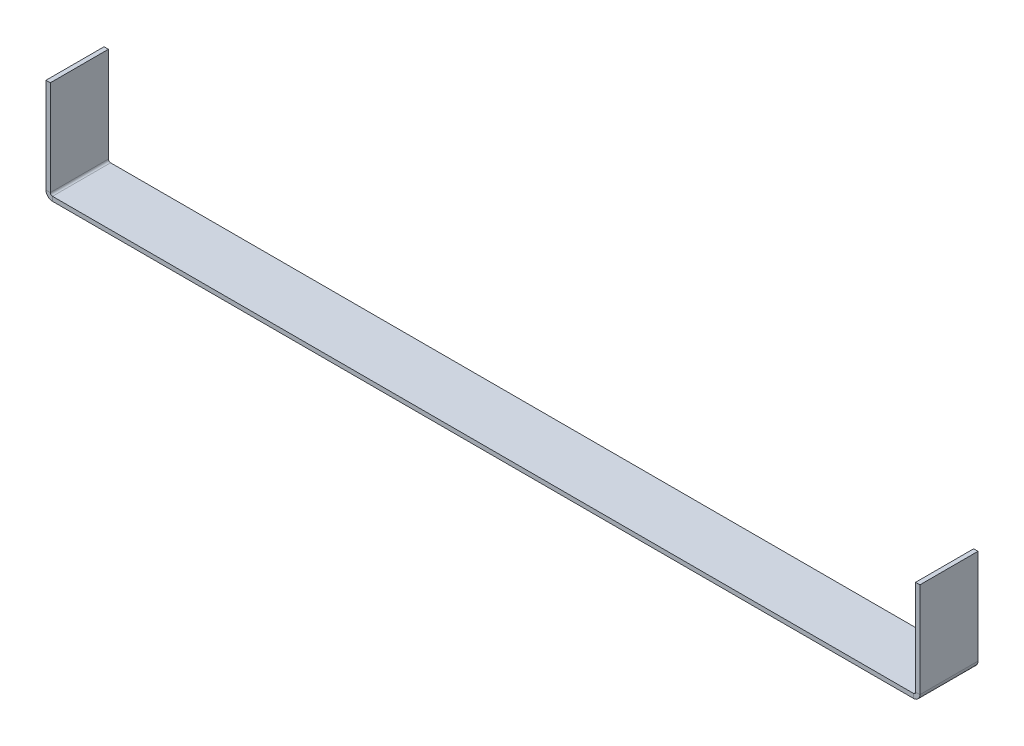
ISO-10303-21;
HEADER;
FILE_DESCRIPTION(('STEP AP214'),'2;1');
FILE_NAME('part.step','',(''),(''),'','','');
FILE_SCHEMA(('AUTOMOTIVE_DESIGN { 1 0 10303 214 1 1 1 1 }'));
ENDSEC;
DATA;
#1=APPLICATION_CONTEXT('core data for automotive mechanical design processes');
#2=APPLICATION_PROTOCOL_DEFINITION('international standard','automotive_design',2000,#1);
#3=PRODUCT_CONTEXT('',#1,'mechanical');
#4=PRODUCT('Part','Part','',(#3));
#5=PRODUCT_RELATED_PRODUCT_CATEGORY('part','',(#4));
#6=PRODUCT_DEFINITION_FORMATION('','',#4);
#7=PRODUCT_DEFINITION_CONTEXT('part definition',#1,'design');
#8=PRODUCT_DEFINITION('design','',#6,#7);
#9=PRODUCT_DEFINITION_SHAPE('','',#8);
#10=(LENGTH_UNIT() NAMED_UNIT(*) SI_UNIT(.MILLI.,.METRE.));
#11=(NAMED_UNIT(*) PLANE_ANGLE_UNIT() SI_UNIT($,.RADIAN.));
#12=(NAMED_UNIT(*) SI_UNIT($,.STERADIAN.) SOLID_ANGLE_UNIT());
#13=UNCERTAINTY_MEASURE_WITH_UNIT(LENGTH_MEASURE(1.E-05),#10,'distance_accuracy_value','');
#14=(GEOMETRIC_REPRESENTATION_CONTEXT(3) GLOBAL_UNCERTAINTY_ASSIGNED_CONTEXT((#13)) GLOBAL_UNIT_ASSIGNED_CONTEXT((#10,
#11,#12)) REPRESENTATION_CONTEXT('',''));
#15=CARTESIAN_POINT('',(0.,0.,0.));
#16=DIRECTION('',(0.,0.,1.));
#17=DIRECTION('',(1.,0.,0.));
#18=AXIS2_PLACEMENT_3D('',#15,#16,#17);
#19=CARTESIAN_POINT('',(0.,-1.5,0.));
#20=DIRECTION('',(0.,-1.,0.));
#21=DIRECTION('',(0.,0.,-1.));
#22=AXIS2_PLACEMENT_3D('',#19,#20,#21);
#23=PLANE('',#22);
#24=DIRECTION('',(-1.,0.,0.));
#25=VECTOR('',#24,1.);
#26=CARTESIAN_POINT('',(0.,-1.5,-20.));
#27=LINE('',#26,#25);
#28=CARTESIAN_POINT('',(298.7634,-1.5,-20.));
#29=VERTEX_POINT('',#28);
#30=CARTESIAN_POINT('',(2.2366,-1.5,-20.));
#31=VERTEX_POINT('',#30);
#32=EDGE_CURVE('E13',#29,#31,#27,.T.);
#33=ORIENTED_EDGE('',*,*,#32,.F.);
#34=DIRECTION('',(0.,0.,-1.));
#35=VECTOR('',#34,1.);
#36=CARTESIAN_POINT('',(298.7634,-1.5,-20.));
#37=LINE('',#36,#35);
#38=CARTESIAN_POINT('',(298.7634,-1.5,0.));
#39=VERTEX_POINT('',#38);
#40=EDGE_CURVE('E326',#29,#39,#37,.F.);
#41=ORIENTED_EDGE('',*,*,#40,.T.);
#42=DIRECTION('',(1.,0.,0.));
#43=VECTOR('',#42,1.);
#44=CARTESIAN_POINT('',(0.,-1.5,0.));
#45=LINE('',#44,#43);
#46=CARTESIAN_POINT('',(2.2366,-1.5,0.));
#47=VERTEX_POINT('',#46);
#48=EDGE_CURVE('E87',#47,#39,#45,.T.);
#49=ORIENTED_EDGE('',*,*,#48,.F.);
#50=DIRECTION('',(0.,0.,1.));
#51=VECTOR('',#50,1.);
#52=CARTESIAN_POINT('',(2.2366,-1.5,0.));
#53=LINE('',#52,#51);
#54=EDGE_CURVE('E101',#47,#31,#53,.F.);
#55=ORIENTED_EDGE('',*,*,#54,.T.);
#56=EDGE_LOOP('',(#33,#41,#49,#55));
#57=FACE_BOUND('',#56,.T.);
#58=ADVANCED_FACE('F78',(#57),#23,.T.);
#59=CARTESIAN_POINT('',(0.,0.,0.));
#60=DIRECTION('',(0.,-1.,0.));
#61=DIRECTION('',(0.,0.,-1.));
#62=AXIS2_PLACEMENT_3D('',#59,#60,#61);
#63=PLANE('',#62);
#64=DIRECTION('',(0.,0.,-1.));
#65=VECTOR('',#64,1.);
#66=CARTESIAN_POINT('',(298.7634,0.,-20.));
#67=LINE('',#66,#65);
#68=CARTESIAN_POINT('',(298.7634,0.,-20.));
#69=VERTEX_POINT('',#68);
#70=CARTESIAN_POINT('',(298.7634,0.,0.));
#71=VERTEX_POINT('',#70);
#72=EDGE_CURVE('E198',#69,#71,#67,.F.);
#73=ORIENTED_EDGE('',*,*,#72,.F.);
#74=DIRECTION('',(-1.,0.,0.));
#75=VECTOR('',#74,1.);
#76=CARTESIAN_POINT('',(0.,0.,-20.));
#77=LINE('',#76,#75);
#78=CARTESIAN_POINT('',(2.2366,0.,-20.));
#79=VERTEX_POINT('',#78);
#80=EDGE_CURVE('E82',#69,#79,#77,.T.);
#81=ORIENTED_EDGE('',*,*,#80,.T.);
#82=DIRECTION('',(0.,0.,1.));
#83=VECTOR('',#82,1.);
#84=CARTESIAN_POINT('',(2.2366,0.,0.));
#85=LINE('',#84,#83);
#86=CARTESIAN_POINT('',(2.2366,0.,0.));
#87=VERTEX_POINT('',#86);
#88=EDGE_CURVE('E145',#87,#79,#85,.F.);
#89=ORIENTED_EDGE('',*,*,#88,.F.);
#90=DIRECTION('',(1.,0.,0.));
#91=VECTOR('',#90,1.);
#92=CARTESIAN_POINT('',(0.,0.,0.));
#93=LINE('',#92,#91);
#94=EDGE_CURVE('E186',#87,#71,#93,.T.);
#95=ORIENTED_EDGE('',*,*,#94,.T.);
#96=EDGE_LOOP('',(#73,#81,#89,#95));
#97=FACE_BOUND('',#96,.T.);
#98=ADVANCED_FACE('F195',(#97),#63,.F.);
#99=CARTESIAN_POINT('',(0.,-1.5,-20.));
#100=DIRECTION('',(0.,0.,-1.));
#101=DIRECTION('',(-1.,0.,0.));
#102=AXIS2_PLACEMENT_3D('',#99,#100,#101);
#103=PLANE('',#102);
#104=ORIENTED_EDGE('',*,*,#80,.F.);
#105=DIRECTION('',(0.,-1.,0.));
#106=VECTOR('',#105,1.);
#107=CARTESIAN_POINT('',(298.7634,0.,-20.));
#108=LINE('',#107,#106);
#109=EDGE_CURVE('E332',#69,#29,#108,.T.);
#110=ORIENTED_EDGE('',*,*,#109,.T.);
#111=ORIENTED_EDGE('',*,*,#32,.T.);
#112=DIRECTION('',(0.,-1.,0.));
#113=VECTOR('',#112,1.);
#114=CARTESIAN_POINT('',(2.2366,0.,-20.));
#115=LINE('',#114,#113);
#116=EDGE_CURVE('E183',#79,#31,#115,.T.);
#117=ORIENTED_EDGE('',*,*,#116,.F.);
#118=EDGE_LOOP('',(#104,#110,#111,#117));
#119=FACE_BOUND('',#118,.T.);
#120=ADVANCED_FACE('F201',(#119),#103,.T.);
#121=CARTESIAN_POINT('',(0.,-1.5,0.));
#122=DIRECTION('',(0.,0.,1.));
#123=DIRECTION('',(1.,0.,0.));
#124=AXIS2_PLACEMENT_3D('',#121,#122,#123);
#125=PLANE('',#124);
#126=DIRECTION('',(0.,-1.,0.));
#127=VECTOR('',#126,1.);
#128=CARTESIAN_POINT('',(298.7634,0.,0.));
#129=LINE('',#128,#127);
#130=EDGE_CURVE('E174',#71,#39,#129,.T.);
#131=ORIENTED_EDGE('',*,*,#130,.F.);
#132=ORIENTED_EDGE('',*,*,#94,.F.);
#133=DIRECTION('',(0.,-1.,0.));
#134=VECTOR('',#133,1.);
#135=CARTESIAN_POINT('',(2.2366,0.,0.));
#136=LINE('',#135,#134);
#137=EDGE_CURVE('E144',#87,#47,#136,.T.);
#138=ORIENTED_EDGE('',*,*,#137,.T.);
#139=ORIENTED_EDGE('',*,*,#48,.T.);
#140=EDGE_LOOP('',(#131,#132,#138,#139));
#141=FACE_BOUND('',#140,.T.);
#142=ADVANCED_FACE('F80',(#141),#125,.T.);
#143=CARTESIAN_POINT('',(2.2366,0.7366,-20.));
#144=DIRECTION('',(0.,0.,-1.));
#145=DIRECTION('',(-1.,0.,0.));
#146=AXIS2_PLACEMENT_3D('',#143,#144,#145);
#147=PLANE('',#146);
#148=DIRECTION('',(1.,0.,0.));
#149=VECTOR('',#148,1.);
#150=CARTESIAN_POINT('',(0.,0.736599999999992,-20.));
#151=LINE('',#150,#149);
#152=CARTESIAN_POINT('',(1.5,0.736599999999997,-20.));
#153=VERTEX_POINT('',#152);
#154=CARTESIAN_POINT('',(0.,0.736599999999992,-20.));
#155=VERTEX_POINT('',#154);
#156=EDGE_CURVE('E135',#153,#155,#151,.F.);
#157=ORIENTED_EDGE('',*,*,#156,.F.);
#158=CARTESIAN_POINT('',(2.2366,0.7366,-20.));
#159=DIRECTION('',(0.,0.,1.));
#160=DIRECTION('',(1.,0.,0.));
#161=AXIS2_PLACEMENT_3D('',#158,#159,#160);
#162=CIRCLE('',#161,0.7366);
#163=EDGE_CURVE('E129',#79,#153,#162,.F.);
#164=ORIENTED_EDGE('',*,*,#163,.F.);
#165=ORIENTED_EDGE('',*,*,#116,.T.);
#166=CARTESIAN_POINT('',(2.2366,0.7366,-20.));
#167=DIRECTION('',(0.,0.,1.));
#168=DIRECTION('',(1.,0.,0.));
#169=AXIS2_PLACEMENT_3D('',#166,#167,#168);
#170=CIRCLE('',#169,2.2366);
#171=EDGE_CURVE('E176',#31,#155,#170,.F.);
#172=ORIENTED_EDGE('',*,*,#171,.T.);
#173=EDGE_LOOP('',(#157,#164,#165,#172));
#174=FACE_BOUND('',#173,.T.);
#175=ADVANCED_FACE('F200',(#174),#147,.T.);
#176=CARTESIAN_POINT('',(2.2366,0.7366,0.));
#177=DIRECTION('',(0.,0.,-1.));
#178=DIRECTION('',(-1.,0.,0.));
#179=AXIS2_PLACEMENT_3D('',#176,#177,#178);
#180=PLANE('',#179);
#181=CARTESIAN_POINT('',(2.2366,0.7366,0.));
#182=DIRECTION('',(0.,0.,1.));
#183=DIRECTION('',(1.,0.,0.));
#184=AXIS2_PLACEMENT_3D('',#181,#182,#183);
#185=CIRCLE('',#184,0.7366);
#186=CARTESIAN_POINT('',(1.5,0.736599999999997,0.));
#187=VERTEX_POINT('',#186);
#188=EDGE_CURVE('E126',#187,#87,#185,.T.);
#189=ORIENTED_EDGE('',*,*,#188,.F.);
#190=DIRECTION('',(1.,0.,0.));
#191=VECTOR('',#190,1.);
#192=CARTESIAN_POINT('',(1.5,0.736599999999997,0.));
#193=LINE('',#192,#191);
#194=CARTESIAN_POINT('',(0.,0.736599999999992,0.));
#195=VERTEX_POINT('',#194);
#196=EDGE_CURVE('E134',#187,#195,#193,.F.);
#197=ORIENTED_EDGE('',*,*,#196,.T.);
#198=CARTESIAN_POINT('',(2.2366,0.7366,0.));
#199=DIRECTION('',(0.,0.,1.));
#200=DIRECTION('',(1.,0.,0.));
#201=AXIS2_PLACEMENT_3D('',#198,#199,#200);
#202=CIRCLE('',#201,2.2366);
#203=EDGE_CURVE('E177',#195,#47,#202,.T.);
#204=ORIENTED_EDGE('',*,*,#203,.T.);
#205=ORIENTED_EDGE('',*,*,#137,.F.);
#206=EDGE_LOOP('',(#189,#197,#204,#205));
#207=FACE_BOUND('',#206,.T.);
#208=ADVANCED_FACE('F140',(#207),#180,.F.);
#209=CARTESIAN_POINT('',(2.2366,0.7366,0.));
#210=DIRECTION('',(0.,0.,1.));
#211=DIRECTION('',(-1.,0.,0.));
#212=AXIS2_PLACEMENT_3D('',#209,#210,#211);
#213=CYLINDRICAL_SURFACE('',#212,2.2366);
#214=ORIENTED_EDGE('',*,*,#54,.F.);
#215=ORIENTED_EDGE('',*,*,#203,.F.);
#216=DIRECTION('',(0.,0.,1.));
#217=VECTOR('',#216,1.);
#218=CARTESIAN_POINT('',(0.,0.736599999999992,-20.));
#219=LINE('',#218,#217);
#220=EDGE_CURVE('E158',#195,#155,#219,.F.);
#221=ORIENTED_EDGE('',*,*,#220,.T.);
#222=ORIENTED_EDGE('',*,*,#171,.F.);
#223=EDGE_LOOP('',(#214,#215,#221,#222));
#224=FACE_BOUND('',#223,.T.);
#225=ADVANCED_FACE('F217',(#224),#213,.T.);
#226=CARTESIAN_POINT('',(2.2366,0.7366,0.));
#227=DIRECTION('',(0.,0.,1.));
#228=DIRECTION('',(-1.,0.,0.));
#229=AXIS2_PLACEMENT_3D('',#226,#227,#228);
#230=CYLINDRICAL_SURFACE('',#229,0.7366);
#231=ORIENTED_EDGE('',*,*,#88,.T.);
#232=ORIENTED_EDGE('',*,*,#163,.T.);
#233=DIRECTION('',(0.,0.,1.));
#234=VECTOR('',#233,1.);
#235=CARTESIAN_POINT('',(1.5,0.736599999999997,-20.));
#236=LINE('',#235,#234);
#237=EDGE_CURVE('E122',#153,#187,#236,.T.);
#238=ORIENTED_EDGE('',*,*,#237,.T.);
#239=ORIENTED_EDGE('',*,*,#188,.T.);
#240=EDGE_LOOP('',(#231,#232,#238,#239));
#241=FACE_BOUND('',#240,.T.);
#242=ADVANCED_FACE('F125',(#241),#230,.F.);
#243=CARTESIAN_POINT('',(0.,0.,-20.));
#244=DIRECTION('',(0.,0.,1.));
#245=DIRECTION('',(1.,0.,0.));
#246=AXIS2_PLACEMENT_3D('',#243,#244,#245);
#247=PLANE('',#246);
#248=ORIENTED_EDGE('',*,*,#156,.T.);
#249=DIRECTION('',(0.,-1.,0.));
#250=VECTOR('',#249,1.);
#251=CARTESIAN_POINT('',(0.,0.,-20.));
#252=LINE('',#251,#250);
#253=CARTESIAN_POINT('',(-1.16964624851245E-13,33.5,-20.));
#254=VERTEX_POINT('',#253);
#255=EDGE_CURVE('E166',#254,#155,#252,.T.);
#256=ORIENTED_EDGE('',*,*,#255,.F.);
#257=DIRECTION('',(1.,0.,0.));
#258=VECTOR('',#257,1.);
#259=CARTESIAN_POINT('',(-1.16964624851245E-13,33.5,-20.));
#260=LINE('',#259,#258);
#261=CARTESIAN_POINT('',(1.49999999999988,33.5,-20.));
#262=VERTEX_POINT('',#261);
#263=EDGE_CURVE('E346',#254,#262,#260,.T.);
#264=ORIENTED_EDGE('',*,*,#263,.T.);
#265=DIRECTION('',(0.,1.,0.));
#266=VECTOR('',#265,1.);
#267=CARTESIAN_POINT('',(1.5,0.,-20.));
#268=LINE('',#267,#266);
#269=EDGE_CURVE('E164',#262,#153,#268,.F.);
#270=ORIENTED_EDGE('',*,*,#269,.T.);
#271=EDGE_LOOP('',(#248,#256,#264,#270));
#272=FACE_BOUND('',#271,.T.);
#273=ADVANCED_FACE('F222',(#272),#247,.F.);
#274=CARTESIAN_POINT('',(-1.16876994193937E-13,33.5,0.));
#275=DIRECTION('',(0.,0.,-1.));
#276=DIRECTION('',(-1.,0.,0.));
#277=AXIS2_PLACEMENT_3D('',#274,#275,#276);
#278=PLANE('',#277);
#279=ORIENTED_EDGE('',*,*,#196,.F.);
#280=DIRECTION('',(0.,-1.,0.));
#281=VECTOR('',#280,1.);
#282=CARTESIAN_POINT('',(1.49999999999988,33.5,0.));
#283=LINE('',#282,#281);
#284=CARTESIAN_POINT('',(1.49999999999988,33.5,0.));
#285=VERTEX_POINT('',#284);
#286=EDGE_CURVE('E154',#187,#285,#283,.F.);
#287=ORIENTED_EDGE('',*,*,#286,.T.);
#288=DIRECTION('',(1.,0.,0.));
#289=VECTOR('',#288,1.);
#290=CARTESIAN_POINT('',(-1.16876994193937E-13,33.5,0.));
#291=LINE('',#290,#289);
#292=CARTESIAN_POINT('',(-1.16964624851245E-13,33.5,0.));
#293=VERTEX_POINT('',#292);
#294=EDGE_CURVE('E146',#293,#285,#291,.T.);
#295=ORIENTED_EDGE('',*,*,#294,.F.);
#296=DIRECTION('',(0.,1.,0.));
#297=VECTOR('',#296,1.);
#298=CARTESIAN_POINT('',(0.,0.,0.));
#299=LINE('',#298,#297);
#300=EDGE_CURVE('E157',#195,#293,#299,.T.);
#301=ORIENTED_EDGE('',*,*,#300,.F.);
#302=EDGE_LOOP('',(#279,#287,#295,#301));
#303=FACE_BOUND('',#302,.T.);
#304=ADVANCED_FACE('F151',(#303),#278,.F.);
#305=CARTESIAN_POINT('',(0.,0.,0.));
#306=DIRECTION('',(1.,0.,0.));
#307=DIRECTION('',(0.,1.,0.));
#308=AXIS2_PLACEMENT_3D('',#305,#306,#307);
#309=PLANE('',#308);
#310=ORIENTED_EDGE('',*,*,#220,.F.);
#311=ORIENTED_EDGE('',*,*,#300,.T.);
#312=DIRECTION('',(0.,0.,-1.));
#313=VECTOR('',#312,1.);
#314=CARTESIAN_POINT('',(-1.16964624851245E-13,33.5,0.));
#315=LINE('',#314,#313);
#316=EDGE_CURVE('E349',#293,#254,#315,.T.);
#317=ORIENTED_EDGE('',*,*,#316,.T.);
#318=ORIENTED_EDGE('',*,*,#255,.T.);
#319=EDGE_LOOP('',(#310,#311,#317,#318));
#320=FACE_BOUND('',#319,.T.);
#321=ADVANCED_FACE('F230',(#320),#309,.F.);
#322=CARTESIAN_POINT('',(1.5,0.,0.));
#323=DIRECTION('',(1.,0.,0.));
#324=DIRECTION('',(0.,1.,0.));
#325=AXIS2_PLACEMENT_3D('',#322,#323,#324);
#326=PLANE('',#325);
#327=ORIENTED_EDGE('',*,*,#286,.F.);
#328=ORIENTED_EDGE('',*,*,#237,.F.);
#329=ORIENTED_EDGE('',*,*,#269,.F.);
#330=DIRECTION('',(0.,0.,1.));
#331=VECTOR('',#330,1.);
#332=CARTESIAN_POINT('',(1.49999999999988,33.5,-20.));
#333=LINE('',#332,#331);
#334=EDGE_CURVE('E163',#285,#262,#333,.F.);
#335=ORIENTED_EDGE('',*,*,#334,.F.);
#336=EDGE_LOOP('',(#327,#328,#329,#335));
#337=FACE_BOUND('',#336,.T.);
#338=ADVANCED_FACE('F161',(#337),#326,.T.);
#339=CARTESIAN_POINT('',(-1.16876994193937E-13,33.5,-20.));
#340=DIRECTION('',(0.,-1.,0.));
#341=DIRECTION('',(1.,0.,0.));
#342=AXIS2_PLACEMENT_3D('',#339,#340,#341);
#343=PLANE('',#342);
#344=ORIENTED_EDGE('',*,*,#334,.T.);
#345=ORIENTED_EDGE('',*,*,#263,.F.);
#346=ORIENTED_EDGE('',*,*,#316,.F.);
#347=ORIENTED_EDGE('',*,*,#294,.T.);
#348=EDGE_LOOP('',(#344,#345,#346,#347));
#349=FACE_BOUND('',#348,.T.);
#350=ADVANCED_FACE('F231',(#349),#343,.F.);
#351=CARTESIAN_POINT('',(298.7634,0.736599999999979,0.));
#352=DIRECTION('',(0.,0.,1.));
#353=DIRECTION('',(1.,0.,0.));
#354=AXIS2_PLACEMENT_3D('',#351,#352,#353);
#355=PLANE('',#354);
#356=DIRECTION('',(-1.,0.,0.));
#357=VECTOR('',#356,1.);
#358=CARTESIAN_POINT('',(301.,0.736599999999971,0.));
#359=LINE('',#358,#357);
#360=CARTESIAN_POINT('',(299.5,0.736599999999976,0.));
#361=VERTEX_POINT('',#360);
#362=CARTESIAN_POINT('',(301.,0.736599999999971,0.));
#363=VERTEX_POINT('',#362);
#364=EDGE_CURVE('E323',#361,#363,#359,.F.);
#365=ORIENTED_EDGE('',*,*,#364,.F.);
#366=CARTESIAN_POINT('',(298.7634,0.736599999999979,0.));
#367=DIRECTION('',(0.,0.,-1.));
#368=DIRECTION('',(-1.,0.,0.));
#369=AXIS2_PLACEMENT_3D('',#366,#367,#368);
#370=CIRCLE('',#369,0.736599999999976);
#371=EDGE_CURVE('E335',#71,#361,#370,.F.);
#372=ORIENTED_EDGE('',*,*,#371,.F.);
#373=ORIENTED_EDGE('',*,*,#130,.T.);
#374=CARTESIAN_POINT('',(298.7634,0.736599999999979,0.));
#375=DIRECTION('',(0.,0.,-1.));
#376=DIRECTION('',(-1.,0.,0.));
#377=AXIS2_PLACEMENT_3D('',#374,#375,#376);
#378=CIRCLE('',#377,2.23659999999998);
#379=EDGE_CURVE('E329',#39,#363,#378,.F.);
#380=ORIENTED_EDGE('',*,*,#379,.T.);
#381=EDGE_LOOP('',(#365,#372,#373,#380));
#382=FACE_BOUND('',#381,.T.);
#383=ADVANCED_FACE('F234',(#382),#355,.T.);
#384=CARTESIAN_POINT('',(298.7634,0.736599999999979,-20.));
#385=DIRECTION('',(0.,0.,1.));
#386=DIRECTION('',(1.,0.,0.));
#387=AXIS2_PLACEMENT_3D('',#384,#385,#386);
#388=PLANE('',#387);
#389=CARTESIAN_POINT('',(298.7634,0.736599999999979,-20.));
#390=DIRECTION('',(0.,0.,-1.));
#391=DIRECTION('',(-1.,0.,0.));
#392=AXIS2_PLACEMENT_3D('',#389,#390,#391);
#393=CIRCLE('',#392,0.736599999999976);
#394=CARTESIAN_POINT('',(299.5,0.736599999999976,-20.));
#395=VERTEX_POINT('',#394);
#396=EDGE_CURVE('E339',#395,#69,#393,.T.);
#397=ORIENTED_EDGE('',*,*,#396,.F.);
#398=DIRECTION('',(-1.,0.,0.));
#399=VECTOR('',#398,1.);
#400=CARTESIAN_POINT('',(299.5,0.736599999999976,-20.));
#401=LINE('',#400,#399);
#402=CARTESIAN_POINT('',(301.,0.736599999999971,-20.));
#403=VERTEX_POINT('',#402);
#404=EDGE_CURVE('E297',#395,#403,#401,.F.);
#405=ORIENTED_EDGE('',*,*,#404,.T.);
#406=CARTESIAN_POINT('',(298.7634,0.736599999999979,-20.));
#407=DIRECTION('',(0.,0.,-1.));
#408=DIRECTION('',(-1.,0.,0.));
#409=AXIS2_PLACEMENT_3D('',#406,#407,#408);
#410=CIRCLE('',#409,2.23659999999998);
#411=EDGE_CURVE('E330',#403,#29,#410,.T.);
#412=ORIENTED_EDGE('',*,*,#411,.T.);
#413=ORIENTED_EDGE('',*,*,#109,.F.);
#414=EDGE_LOOP('',(#397,#405,#412,#413));
#415=FACE_BOUND('',#414,.T.);
#416=ADVANCED_FACE('F241',(#415),#388,.F.);
#417=CARTESIAN_POINT('',(298.7634,0.736599999999979,-20.));
#418=DIRECTION('',(0.,0.,-1.));
#419=DIRECTION('',(1.,0.,0.));
#420=AXIS2_PLACEMENT_3D('',#417,#418,#419);
#421=CYLINDRICAL_SURFACE('',#420,2.23659999999998);
#422=ORIENTED_EDGE('',*,*,#40,.F.);
#423=ORIENTED_EDGE('',*,*,#411,.F.);
#424=DIRECTION('',(0.,0.,-1.));
#425=VECTOR('',#424,1.);
#426=CARTESIAN_POINT('',(301.,0.736599999999971,0.));
#427=LINE('',#426,#425);
#428=EDGE_CURVE('E282',#403,#363,#427,.F.);
#429=ORIENTED_EDGE('',*,*,#428,.T.);
#430=ORIENTED_EDGE('',*,*,#379,.F.);
#431=EDGE_LOOP('',(#422,#423,#429,#430));
#432=FACE_BOUND('',#431,.T.);
#433=ADVANCED_FACE('F244',(#432),#421,.T.);
#434=CARTESIAN_POINT('',(298.7634,0.736599999999979,-20.));
#435=DIRECTION('',(0.,0.,-1.));
#436=DIRECTION('',(1.,0.,0.));
#437=AXIS2_PLACEMENT_3D('',#434,#435,#436);
#438=CYLINDRICAL_SURFACE('',#437,0.736599999999976);
#439=ORIENTED_EDGE('',*,*,#72,.T.);
#440=ORIENTED_EDGE('',*,*,#371,.T.);
#441=DIRECTION('',(0.,0.,-1.));
#442=VECTOR('',#441,1.);
#443=CARTESIAN_POINT('',(299.5,0.736599999999976,0.));
#444=LINE('',#443,#442);
#445=EDGE_CURVE('E320',#361,#395,#444,.T.);
#446=ORIENTED_EDGE('',*,*,#445,.T.);
#447=ORIENTED_EDGE('',*,*,#396,.T.);
#448=EDGE_LOOP('',(#439,#440,#446,#447));
#449=FACE_BOUND('',#448,.T.);
#450=ADVANCED_FACE('F249',(#449),#438,.F.);
#451=CARTESIAN_POINT('',(301.,33.5,-20.));
#452=DIRECTION('',(0.,0.,1.));
#453=DIRECTION('',(1.,0.,0.));
#454=AXIS2_PLACEMENT_3D('',#451,#452,#453);
#455=PLANE('',#454);
#456=ORIENTED_EDGE('',*,*,#404,.F.);
#457=DIRECTION('',(0.,-1.,0.));
#458=VECTOR('',#457,1.);
#459=CARTESIAN_POINT('',(299.5,33.5,-20.));
#460=LINE('',#459,#458);
#461=CARTESIAN_POINT('',(299.5,33.5,-20.));
#462=VERTEX_POINT('',#461);
#463=EDGE_CURVE('E296',#395,#462,#460,.F.);
#464=ORIENTED_EDGE('',*,*,#463,.T.);
#465=DIRECTION('',(-1.,0.,0.));
#466=VECTOR('',#465,1.);
#467=CARTESIAN_POINT('',(301.,33.5,-20.));
#468=LINE('',#467,#466);
#469=CARTESIAN_POINT('',(301.,33.5,-20.));
#470=VERTEX_POINT('',#469);
#471=EDGE_CURVE('E305',#470,#462,#468,.T.);
#472=ORIENTED_EDGE('',*,*,#471,.F.);
#473=DIRECTION('',(0.,1.,0.));
#474=VECTOR('',#473,1.);
#475=CARTESIAN_POINT('',(301.,-1.00278089488042E-12,-20.));
#476=LINE('',#475,#474);
#477=EDGE_CURVE('E286',#403,#470,#476,.T.);
#478=ORIENTED_EDGE('',*,*,#477,.F.);
#479=EDGE_LOOP('',(#456,#464,#472,#478));
#480=FACE_BOUND('',#479,.T.);
#481=ADVANCED_FACE('F252',(#480),#455,.F.);
#482=CARTESIAN_POINT('',(301.,0.,0.));
#483=DIRECTION('',(0.,0.,-1.));
#484=DIRECTION('',(-1.,0.,0.));
#485=AXIS2_PLACEMENT_3D('',#482,#483,#484);
#486=PLANE('',#485);
#487=ORIENTED_EDGE('',*,*,#364,.T.);
#488=DIRECTION('',(0.,-1.,0.));
#489=VECTOR('',#488,1.);
#490=CARTESIAN_POINT('',(301.,-1.00278089488042E-12,0.));
#491=LINE('',#490,#489);
#492=CARTESIAN_POINT('',(301.,33.5,0.));
#493=VERTEX_POINT('',#492);
#494=EDGE_CURVE('E290',#493,#363,#491,.T.);
#495=ORIENTED_EDGE('',*,*,#494,.F.);
#496=DIRECTION('',(-1.,0.,0.));
#497=VECTOR('',#496,1.);
#498=CARTESIAN_POINT('',(301.,33.5,0.));
#499=LINE('',#498,#497);
#500=CARTESIAN_POINT('',(299.5,33.5,0.));
#501=VERTEX_POINT('',#500);
#502=EDGE_CURVE('E385',#493,#501,#499,.T.);
#503=ORIENTED_EDGE('',*,*,#502,.T.);
#504=DIRECTION('',(0.,1.,0.));
#505=VECTOR('',#504,1.);
#506=CARTESIAN_POINT('',(299.5,0.,0.));
#507=LINE('',#506,#505);
#508=EDGE_CURVE('E308',#501,#361,#507,.F.);
#509=ORIENTED_EDGE('',*,*,#508,.T.);
#510=EDGE_LOOP('',(#487,#495,#503,#509));
#511=FACE_BOUND('',#510,.T.);
#512=ADVANCED_FACE('F259',(#511),#486,.F.);
#513=CARTESIAN_POINT('',(301.,-1.00278089488042E-12,0.));
#514=DIRECTION('',(-1.,0.,0.));
#515=DIRECTION('',(0.,-1.,0.));
#516=AXIS2_PLACEMENT_3D('',#513,#514,#515);
#517=PLANE('',#516);
#518=ORIENTED_EDGE('',*,*,#428,.F.);
#519=ORIENTED_EDGE('',*,*,#477,.T.);
#520=DIRECTION('',(0.,0.,1.));
#521=VECTOR('',#520,1.);
#522=CARTESIAN_POINT('',(301.,33.5,0.));
#523=LINE('',#522,#521);
#524=EDGE_CURVE('E307',#470,#493,#523,.T.);
#525=ORIENTED_EDGE('',*,*,#524,.T.);
#526=ORIENTED_EDGE('',*,*,#494,.T.);
#527=EDGE_LOOP('',(#518,#519,#525,#526));
#528=FACE_BOUND('',#527,.T.);
#529=ADVANCED_FACE('F268',(#528),#517,.F.);
#530=CARTESIAN_POINT('',(299.5,-9.97543672872155E-13,0.));
#531=DIRECTION('',(-1.,0.,0.));
#532=DIRECTION('',(0.,-1.,0.));
#533=AXIS2_PLACEMENT_3D('',#530,#531,#532);
#534=PLANE('',#533);
#535=ORIENTED_EDGE('',*,*,#463,.F.);
#536=ORIENTED_EDGE('',*,*,#445,.F.);
#537=ORIENTED_EDGE('',*,*,#508,.F.);
#538=DIRECTION('',(0.,0.,-1.));
#539=VECTOR('',#538,1.);
#540=CARTESIAN_POINT('',(299.5,33.5,0.));
#541=LINE('',#540,#539);
#542=EDGE_CURVE('E312',#462,#501,#541,.F.);
#543=ORIENTED_EDGE('',*,*,#542,.F.);
#544=EDGE_LOOP('',(#535,#536,#537,#543));
#545=FACE_BOUND('',#544,.T.);
#546=ADVANCED_FACE('F264',(#545),#534,.T.);
#547=CARTESIAN_POINT('',(301.,33.5,0.));
#548=DIRECTION('',(0.,-1.,0.));
#549=DIRECTION('',(1.,0.,0.));
#550=AXIS2_PLACEMENT_3D('',#547,#548,#549);
#551=PLANE('',#550);
#552=ORIENTED_EDGE('',*,*,#542,.T.);
#553=ORIENTED_EDGE('',*,*,#502,.F.);
#554=ORIENTED_EDGE('',*,*,#524,.F.);
#555=ORIENTED_EDGE('',*,*,#471,.T.);
#556=EDGE_LOOP('',(#552,#553,#554,#555));
#557=FACE_BOUND('',#556,.T.);
#558=ADVANCED_FACE('F261',(#557),#551,.F.);
#559=CLOSED_SHELL('',(#58,#98,#120,#142,#175,#208,#225,#242,#273,#304,#321,#338,#350,#383,#416,
#433,#450,#481,#512,#529,#546,#558));
#560=MANIFOLD_SOLID_BREP('B2',#559);
#561=ADVANCED_BREP_SHAPE_REPRESENTATION('',(#18,#560),#14);
#562=SHAPE_DEFINITION_REPRESENTATION(#9,#561);
ENDSEC;
END-ISO-10303-21;
